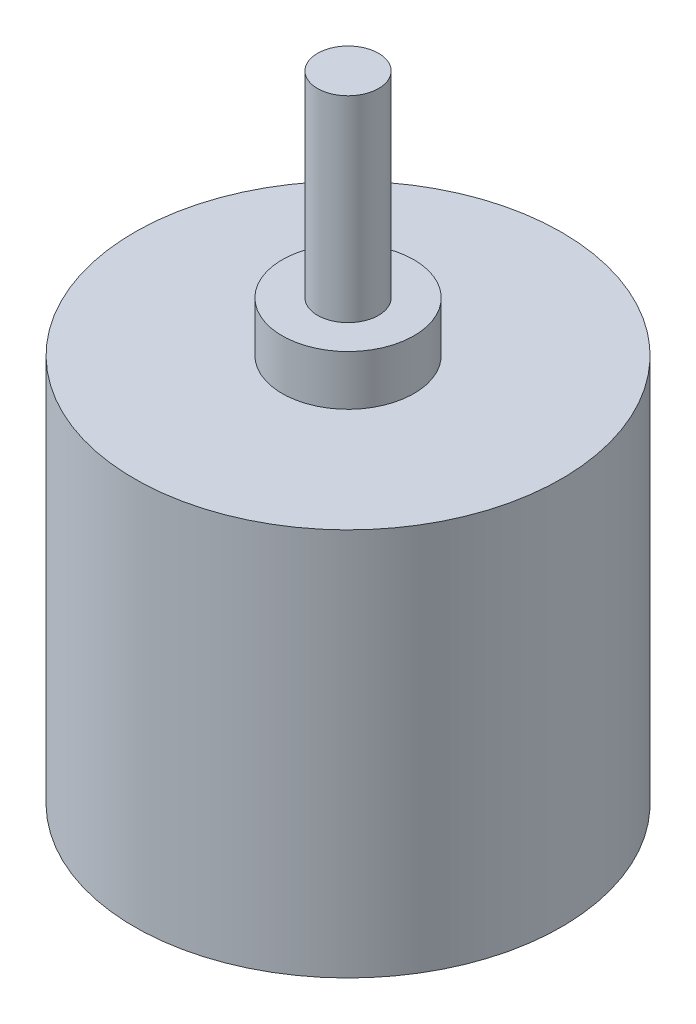
ISO-10303-21;
HEADER;
FILE_DESCRIPTION(('STEP AP214'),'2;1');
FILE_NAME('part.step','',(''),(''),'','','');
FILE_SCHEMA(('AUTOMOTIVE_DESIGN { 1 0 10303 214 1 1 1 1 }'));
ENDSEC;
DATA;
#1=APPLICATION_CONTEXT('core data for automotive mechanical design processes');
#2=APPLICATION_PROTOCOL_DEFINITION('international standard','automotive_design',2000,#1);
#3=PRODUCT_CONTEXT('',#1,'mechanical');
#4=PRODUCT('Part','Part','',(#3));
#5=PRODUCT_RELATED_PRODUCT_CATEGORY('part','',(#4));
#6=PRODUCT_DEFINITION_FORMATION('','',#4);
#7=PRODUCT_DEFINITION_CONTEXT('part definition',#1,'design');
#8=PRODUCT_DEFINITION('design','',#6,#7);
#9=PRODUCT_DEFINITION_SHAPE('','',#8);
#10=(LENGTH_UNIT() NAMED_UNIT(*) SI_UNIT(.MILLI.,.METRE.));
#11=(NAMED_UNIT(*) PLANE_ANGLE_UNIT() SI_UNIT($,.RADIAN.));
#12=(NAMED_UNIT(*) SI_UNIT($,.STERADIAN.) SOLID_ANGLE_UNIT());
#13=UNCERTAINTY_MEASURE_WITH_UNIT(LENGTH_MEASURE(1.E-05),#10,'distance_accuracy_value','');
#14=(GEOMETRIC_REPRESENTATION_CONTEXT(3) GLOBAL_UNCERTAINTY_ASSIGNED_CONTEXT((#13)) GLOBAL_UNIT_ASSIGNED_CONTEXT((#10,
#11,#12)) REPRESENTATION_CONTEXT('',''));
#15=CARTESIAN_POINT('',(0.,0.,0.));
#16=DIRECTION('',(0.,0.,1.));
#17=DIRECTION('',(1.,0.,0.));
#18=AXIS2_PLACEMENT_3D('',#15,#16,#17);
#19=CARTESIAN_POINT('',(0.,-26.75,0.));
#20=DIRECTION('',(0.,-1.,0.));
#21=DIRECTION('',(0.,0.,-1.));
#22=AXIS2_PLACEMENT_3D('',#19,#20,#21);
#23=PLANE('',#22);
#24=CARTESIAN_POINT('',(0.,-26.75,0.));
#25=DIRECTION('',(0.,-1.,0.));
#26=DIRECTION('',(0.,0.,-1.));
#27=AXIS2_PLACEMENT_3D('',#24,#25,#26);
#28=CIRCLE('',#27,2.50000000000001);
#29=CARTESIAN_POINT('',(0.,-26.75,-2.50000000000001));
#30=VERTEX_POINT('',#29);
#31=EDGE_CURVE('E10',#30,#30,#28,.T.);
#32=ORIENTED_EDGE('',*,*,#31,.T.);
#33=EDGE_LOOP('',(#32));
#34=FACE_BOUND('',#33,.T.);
#35=ADVANCED_FACE('F36',(#34),#23,.T.);
#36=CARTESIAN_POINT('',(0.,-45.7891459074558,0.));
#37=DIRECTION('',(0.,-1.,0.));
#38=DIRECTION('',(0.,0.,-1.));
#39=AXIS2_PLACEMENT_3D('',#36,#37,#38);
#40=CYLINDRICAL_SURFACE('',#39,2.50000000000001);
#41=CARTESIAN_POINT('',(0.,-25.25,0.));
#42=DIRECTION('',(0.,-1.,0.));
#43=DIRECTION('',(0.,0.,-1.));
#44=AXIS2_PLACEMENT_3D('',#41,#42,#43);
#45=CIRCLE('',#44,2.50000000000001);
#46=CARTESIAN_POINT('',(0.,-25.25,-2.50000000000001));
#47=VERTEX_POINT('',#46);
#48=EDGE_CURVE('E43',#47,#47,#45,.T.);
#49=ORIENTED_EDGE('',*,*,#48,.T.);
#50=EDGE_LOOP('',(#49));
#51=FACE_BOUND('',#50,.T.);
#52=ORIENTED_EDGE('',*,*,#31,.F.);
#53=EDGE_LOOP('',(#52));
#54=FACE_BOUND('',#53,.T.);
#55=ADVANCED_FACE('F121',(#51,#54),#40,.T.);
#56=CARTESIAN_POINT('',(2.50000000000001,-25.25,0.));
#57=DIRECTION('',(0.,-1.,0.));
#58=DIRECTION('',(0.,0.,-1.));
#59=AXIS2_PLACEMENT_3D('',#56,#57,#58);
#60=PLANE('',#59);
#61=CARTESIAN_POINT('',(0.,-25.25,9.25));
#62=DIRECTION('',(0.,-1.,0.));
#63=DIRECTION('',(0.,0.,-1.));
#64=AXIS2_PLACEMENT_3D('',#61,#62,#63);
#65=CIRCLE('',#64,1.5);
#66=CARTESIAN_POINT('',(0.,-25.25,7.75));
#67=VERTEX_POINT('',#66);
#68=EDGE_CURVE('E100',#67,#67,#65,.T.);
#69=ORIENTED_EDGE('',*,*,#68,.F.);
#70=EDGE_LOOP('',(#69));
#71=FACE_BOUND('',#70,.T.);
#72=CARTESIAN_POINT('',(12.,-25.25,0.));
#73=DIRECTION('',(0.,-1.,0.));
#74=DIRECTION('',(0.,0.,-1.));
#75=AXIS2_PLACEMENT_3D('',#72,#73,#74);
#76=CIRCLE('',#75,1.5);
#77=CARTESIAN_POINT('',(12.,-25.25,-1.5));
#78=VERTEX_POINT('',#77);
#79=EDGE_CURVE('E92',#78,#78,#76,.T.);
#80=ORIENTED_EDGE('',*,*,#79,.F.);
#81=EDGE_LOOP('',(#80));
#82=FACE_BOUND('',#81,.T.);
#83=CARTESIAN_POINT('',(0.,-25.25,-9.25));
#84=DIRECTION('',(0.,-1.,0.));
#85=DIRECTION('',(0.,0.,-1.));
#86=AXIS2_PLACEMENT_3D('',#83,#84,#85);
#87=CIRCLE('',#86,1.5);
#88=CARTESIAN_POINT('',(0.,-25.25,-10.75));
#89=VERTEX_POINT('',#88);
#90=EDGE_CURVE('E84',#89,#89,#87,.T.);
#91=ORIENTED_EDGE('',*,*,#90,.F.);
#92=EDGE_LOOP('',(#91));
#93=FACE_BOUND('',#92,.T.);
#94=CARTESIAN_POINT('',(-12.,-25.25,0.));
#95=DIRECTION('',(0.,-1.,0.));
#96=DIRECTION('',(0.,0.,-1.));
#97=AXIS2_PLACEMENT_3D('',#94,#95,#96);
#98=CIRCLE('',#97,1.5);
#99=CARTESIAN_POINT('',(-12.,-25.25,-1.5));
#100=VERTEX_POINT('',#99);
#101=EDGE_CURVE('E76',#100,#100,#98,.T.);
#102=ORIENTED_EDGE('',*,*,#101,.F.);
#103=EDGE_LOOP('',(#102));
#104=FACE_BOUND('',#103,.T.);
#105=CARTESIAN_POINT('',(0.,-25.25,0.));
#106=DIRECTION('',(0.,-1.,0.));
#107=DIRECTION('',(0.,0.,-1.));
#108=AXIS2_PLACEMENT_3D('',#105,#106,#107);
#109=CIRCLE('',#108,17.5);
#110=CARTESIAN_POINT('',(0.,-25.25,-17.5));
#111=VERTEX_POINT('',#110);
#112=EDGE_CURVE('E48',#111,#111,#109,.T.);
#113=ORIENTED_EDGE('',*,*,#112,.T.);
#114=EDGE_LOOP('',(#113));
#115=FACE_BOUND('',#114,.T.);
#116=ORIENTED_EDGE('',*,*,#48,.F.);
#117=EDGE_LOOP('',(#116));
#118=FACE_BOUND('',#117,.T.);
#119=ADVANCED_FACE('F117',(#71,#82,#93,#104,#115,#118),#60,.T.);
#120=CARTESIAN_POINT('',(0.,-45.7891459074558,0.));
#121=DIRECTION('',(0.,-1.,0.));
#122=DIRECTION('',(0.,0.,-1.));
#123=AXIS2_PLACEMENT_3D('',#120,#121,#122);
#124=CYLINDRICAL_SURFACE('',#123,17.5);
#125=CARTESIAN_POINT('',(0.,6.55000000000001,0.));
#126=DIRECTION('',(0.,-1.,0.));
#127=DIRECTION('',(0.,0.,-1.));
#128=AXIS2_PLACEMENT_3D('',#125,#126,#127);
#129=CIRCLE('',#128,17.5);
#130=CARTESIAN_POINT('',(0.,6.55000000000001,-17.5));
#131=VERTEX_POINT('',#130);
#132=EDGE_CURVE('E53',#131,#131,#129,.T.);
#133=ORIENTED_EDGE('',*,*,#132,.T.);
#134=EDGE_LOOP('',(#133));
#135=FACE_BOUND('',#134,.T.);
#136=ORIENTED_EDGE('',*,*,#112,.F.);
#137=EDGE_LOOP('',(#136));
#138=FACE_BOUND('',#137,.T.);
#139=ADVANCED_FACE('F120',(#135,#138),#124,.T.);
#140=CARTESIAN_POINT('',(5.4,6.55,0.));
#141=DIRECTION('',(0.,1.,0.));
#142=DIRECTION('',(0.,0.,1.));
#143=AXIS2_PLACEMENT_3D('',#140,#141,#142);
#144=PLANE('',#143);
#145=CARTESIAN_POINT('',(0.,6.55000000000001,0.));
#146=DIRECTION('',(0.,-1.,0.));
#147=DIRECTION('',(0.,0.,-1.));
#148=AXIS2_PLACEMENT_3D('',#145,#146,#147);
#149=CIRCLE('',#148,5.4);
#150=CARTESIAN_POINT('',(0.,6.55000000000001,-5.4));
#151=VERTEX_POINT('',#150);
#152=EDGE_CURVE('E59',#151,#151,#149,.T.);
#153=ORIENTED_EDGE('',*,*,#152,.T.);
#154=EDGE_LOOP('',(#153));
#155=FACE_BOUND('',#154,.T.);
#156=ORIENTED_EDGE('',*,*,#132,.F.);
#157=EDGE_LOOP('',(#156));
#158=FACE_BOUND('',#157,.T.);
#159=ADVANCED_FACE('F133',(#155,#158),#144,.T.);
#160=CARTESIAN_POINT('',(0.,-45.7891459074558,0.));
#161=DIRECTION('',(0.,-1.,0.));
#162=DIRECTION('',(0.,0.,-1.));
#163=AXIS2_PLACEMENT_3D('',#160,#161,#162);
#164=CYLINDRICAL_SURFACE('',#163,5.4);
#165=CARTESIAN_POINT('',(0.,10.65,0.));
#166=DIRECTION('',(0.,-1.,0.));
#167=DIRECTION('',(0.,0.,-1.));
#168=AXIS2_PLACEMENT_3D('',#165,#166,#167);
#169=CIRCLE('',#168,5.4);
#170=CARTESIAN_POINT('',(0.,10.65,-5.4));
#171=VERTEX_POINT('',#170);
#172=EDGE_CURVE('E63',#171,#171,#169,.T.);
#173=ORIENTED_EDGE('',*,*,#172,.T.);
#174=EDGE_LOOP('',(#173));
#175=FACE_BOUND('',#174,.T.);
#176=ORIENTED_EDGE('',*,*,#152,.F.);
#177=EDGE_LOOP('',(#176));
#178=FACE_BOUND('',#177,.T.);
#179=ADVANCED_FACE('F140',(#175,#178),#164,.T.);
#180=CARTESIAN_POINT('',(2.5,10.65,0.));
#181=DIRECTION('',(0.,1.,0.));
#182=DIRECTION('',(0.,0.,1.));
#183=AXIS2_PLACEMENT_3D('',#180,#181,#182);
#184=PLANE('',#183);
#185=CARTESIAN_POINT('',(0.,10.65,0.));
#186=DIRECTION('',(0.,-1.,0.));
#187=DIRECTION('',(0.,0.,-1.));
#188=AXIS2_PLACEMENT_3D('',#185,#186,#187);
#189=CIRCLE('',#188,2.5);
#190=CARTESIAN_POINT('',(0.,10.65,-2.5));
#191=VERTEX_POINT('',#190);
#192=EDGE_CURVE('E67',#191,#191,#189,.T.);
#193=ORIENTED_EDGE('',*,*,#192,.T.);
#194=EDGE_LOOP('',(#193));
#195=FACE_BOUND('',#194,.T.);
#196=ORIENTED_EDGE('',*,*,#172,.F.);
#197=EDGE_LOOP('',(#196));
#198=FACE_BOUND('',#197,.T.);
#199=ADVANCED_FACE('F243',(#195,#198),#184,.T.);
#200=CARTESIAN_POINT('',(0.,-45.7891459074558,0.));
#201=DIRECTION('',(0.,-1.,0.));
#202=DIRECTION('',(0.,0.,-1.));
#203=AXIS2_PLACEMENT_3D('',#200,#201,#202);
#204=CYLINDRICAL_SURFACE('',#203,2.5);
#205=CARTESIAN_POINT('',(0.,26.75,0.));
#206=DIRECTION('',(0.,-1.,0.));
#207=DIRECTION('',(0.,0.,-1.));
#208=AXIS2_PLACEMENT_3D('',#205,#206,#207);
#209=CIRCLE('',#208,2.50000000000001);
#210=CARTESIAN_POINT('',(0.,26.75,-2.50000000000001));
#211=VERTEX_POINT('',#210);
#212=EDGE_CURVE('E71',#211,#211,#209,.T.);
#213=ORIENTED_EDGE('',*,*,#212,.T.);
#214=EDGE_LOOP('',(#213));
#215=FACE_BOUND('',#214,.T.);
#216=ORIENTED_EDGE('',*,*,#192,.F.);
#217=EDGE_LOOP('',(#216));
#218=FACE_BOUND('',#217,.T.);
#219=ADVANCED_FACE('F239',(#215,#218),#204,.T.);
#220=CARTESIAN_POINT('',(0.,26.75,0.));
#221=DIRECTION('',(0.,1.,0.));
#222=DIRECTION('',(0.,0.,1.));
#223=AXIS2_PLACEMENT_3D('',#220,#221,#222);
#224=PLANE('',#223);
#225=ORIENTED_EDGE('',*,*,#212,.F.);
#226=EDGE_LOOP('',(#225));
#227=FACE_BOUND('',#226,.T.);
#228=ADVANCED_FACE('F160',(#227),#224,.T.);
#229=CARTESIAN_POINT('',(-12.,-20.25,0.));
#230=DIRECTION('',(0.,-1.,0.));
#231=DIRECTION('',(0.,0.,-1.));
#232=AXIS2_PLACEMENT_3D('',#229,#230,#231);
#233=CYLINDRICAL_SURFACE('',#232,1.5);
#234=CARTESIAN_POINT('',(-12.,-20.25,0.));
#235=DIRECTION('',(0.,-1.,0.));
#236=DIRECTION('',(0.,0.,-1.));
#237=AXIS2_PLACEMENT_3D('',#234,#235,#236);
#238=CIRCLE('',#237,1.5);
#239=CARTESIAN_POINT('',(-12.,-20.25,-1.5));
#240=VERTEX_POINT('',#239);
#241=EDGE_CURVE('E80',#240,#240,#238,.T.);
#242=ORIENTED_EDGE('',*,*,#241,.F.);
#243=EDGE_LOOP('',(#242));
#244=FACE_BOUND('',#243,.T.);
#245=ORIENTED_EDGE('',*,*,#101,.T.);
#246=EDGE_LOOP('',(#245));
#247=FACE_BOUND('',#246,.T.);
#248=ADVANCED_FACE('F165',(#244,#247),#233,.F.);
#249=CARTESIAN_POINT('',(-12.,-20.25,0.));
#250=DIRECTION('',(0.,-1.,0.));
#251=DIRECTION('',(0.,0.,-1.));
#252=AXIS2_PLACEMENT_3D('',#249,#250,#251);
#253=PLANE('',#252);
#254=ORIENTED_EDGE('',*,*,#241,.T.);
#255=EDGE_LOOP('',(#254));
#256=FACE_BOUND('',#255,.T.);
#257=ADVANCED_FACE('F170',(#256),#253,.T.);
#258=CARTESIAN_POINT('',(0.,-20.25,-9.25));
#259=DIRECTION('',(0.,-1.,0.));
#260=DIRECTION('',(0.,0.,-1.));
#261=AXIS2_PLACEMENT_3D('',#258,#259,#260);
#262=CYLINDRICAL_SURFACE('',#261,1.5);
#263=CARTESIAN_POINT('',(0.,-20.25,-9.25));
#264=DIRECTION('',(0.,-1.,0.));
#265=DIRECTION('',(0.,0.,-1.));
#266=AXIS2_PLACEMENT_3D('',#263,#264,#265);
#267=CIRCLE('',#266,1.5);
#268=CARTESIAN_POINT('',(0.,-20.25,-10.75));
#269=VERTEX_POINT('',#268);
#270=EDGE_CURVE('E88',#269,#269,#267,.T.);
#271=ORIENTED_EDGE('',*,*,#270,.F.);
#272=EDGE_LOOP('',(#271));
#273=FACE_BOUND('',#272,.T.);
#274=ORIENTED_EDGE('',*,*,#90,.T.);
#275=EDGE_LOOP('',(#274));
#276=FACE_BOUND('',#275,.T.);
#277=ADVANCED_FACE('F180',(#273,#276),#262,.F.);
#278=CARTESIAN_POINT('',(0.,-20.25,-9.25));
#279=DIRECTION('',(0.,-1.,0.));
#280=DIRECTION('',(0.,0.,-1.));
#281=AXIS2_PLACEMENT_3D('',#278,#279,#280);
#282=PLANE('',#281);
#283=ORIENTED_EDGE('',*,*,#270,.T.);
#284=EDGE_LOOP('',(#283));
#285=FACE_BOUND('',#284,.T.);
#286=ADVANCED_FACE('F190',(#285),#282,.T.);
#287=CARTESIAN_POINT('',(12.,-20.25,0.));
#288=DIRECTION('',(0.,-1.,0.));
#289=DIRECTION('',(0.,0.,-1.));
#290=AXIS2_PLACEMENT_3D('',#287,#288,#289);
#291=CYLINDRICAL_SURFACE('',#290,1.5);
#292=CARTESIAN_POINT('',(12.,-20.25,0.));
#293=DIRECTION('',(0.,-1.,0.));
#294=DIRECTION('',(0.,0.,-1.));
#295=AXIS2_PLACEMENT_3D('',#292,#293,#294);
#296=CIRCLE('',#295,1.5);
#297=CARTESIAN_POINT('',(12.,-20.25,-1.5));
#298=VERTEX_POINT('',#297);
#299=EDGE_CURVE('E96',#298,#298,#296,.T.);
#300=ORIENTED_EDGE('',*,*,#299,.F.);
#301=EDGE_LOOP('',(#300));
#302=FACE_BOUND('',#301,.T.);
#303=ORIENTED_EDGE('',*,*,#79,.T.);
#304=EDGE_LOOP('',(#303));
#305=FACE_BOUND('',#304,.T.);
#306=ADVANCED_FACE('F200',(#302,#305),#291,.F.);
#307=CARTESIAN_POINT('',(12.,-20.25,0.));
#308=DIRECTION('',(0.,-1.,0.));
#309=DIRECTION('',(0.,0.,-1.));
#310=AXIS2_PLACEMENT_3D('',#307,#308,#309);
#311=PLANE('',#310);
#312=ORIENTED_EDGE('',*,*,#299,.T.);
#313=EDGE_LOOP('',(#312));
#314=FACE_BOUND('',#313,.T.);
#315=ADVANCED_FACE('F113',(#314),#311,.T.);
#316=CARTESIAN_POINT('',(0.,-20.25,9.25));
#317=DIRECTION('',(0.,-1.,0.));
#318=DIRECTION('',(0.,0.,-1.));
#319=AXIS2_PLACEMENT_3D('',#316,#317,#318);
#320=CYLINDRICAL_SURFACE('',#319,1.5);
#321=CARTESIAN_POINT('',(0.,-20.25,9.25));
#322=DIRECTION('',(0.,-1.,0.));
#323=DIRECTION('',(0.,0.,-1.));
#324=AXIS2_PLACEMENT_3D('',#321,#322,#323);
#325=CIRCLE('',#324,1.5);
#326=CARTESIAN_POINT('',(0.,-20.25,7.75));
#327=VERTEX_POINT('',#326);
#328=EDGE_CURVE('E75',#327,#327,#325,.T.);
#329=ORIENTED_EDGE('',*,*,#328,.F.);
#330=EDGE_LOOP('',(#329));
#331=FACE_BOUND('',#330,.T.);
#332=ORIENTED_EDGE('',*,*,#68,.T.);
#333=EDGE_LOOP('',(#332));
#334=FACE_BOUND('',#333,.T.);
#335=ADVANCED_FACE('F110',(#331,#334),#320,.F.);
#336=CARTESIAN_POINT('',(0.,-20.25,9.25));
#337=DIRECTION('',(0.,-1.,0.));
#338=DIRECTION('',(0.,0.,-1.));
#339=AXIS2_PLACEMENT_3D('',#336,#337,#338);
#340=PLANE('',#339);
#341=ORIENTED_EDGE('',*,*,#328,.T.);
#342=EDGE_LOOP('',(#341));
#343=FACE_BOUND('',#342,.T.);
#344=ADVANCED_FACE('F108',(#343),#340,.T.);
#345=CLOSED_SHELL('',(#35,#55,#119,#139,#159,#179,#199,#219,#228,#248,#257,#277,#286,#306,#315,
#335,#344));
#346=MANIFOLD_SOLID_BREP('B2',#345);
#347=ADVANCED_BREP_SHAPE_REPRESENTATION('',(#18,#346),#14);
#348=SHAPE_DEFINITION_REPRESENTATION(#9,#347);
ENDSEC;
END-ISO-10303-21;
